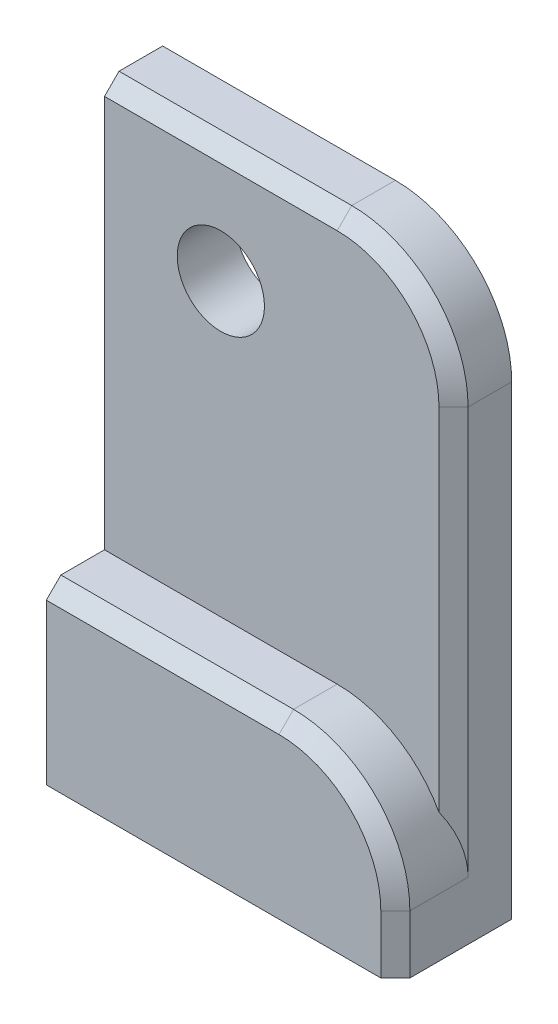
ISO-10303-21;
HEADER;
FILE_DESCRIPTION(('STEP AP214'),'2;1');
FILE_NAME('part.step','',(''),(''),'','','');
FILE_SCHEMA(('AUTOMOTIVE_DESIGN { 1 0 10303 214 1 1 1 1 }'));
ENDSEC;
DATA;
#1=APPLICATION_CONTEXT('core data for automotive mechanical design processes');
#2=APPLICATION_PROTOCOL_DEFINITION('international standard','automotive_design',2000,#1);
#3=PRODUCT_CONTEXT('',#1,'mechanical');
#4=PRODUCT('Part','Part','',(#3));
#5=PRODUCT_RELATED_PRODUCT_CATEGORY('part','',(#4));
#6=PRODUCT_DEFINITION_FORMATION('','',#4);
#7=PRODUCT_DEFINITION_CONTEXT('part definition',#1,'design');
#8=PRODUCT_DEFINITION('design','',#6,#7);
#9=PRODUCT_DEFINITION_SHAPE('','',#8);
#10=(LENGTH_UNIT() NAMED_UNIT(*) SI_UNIT(.MILLI.,.METRE.));
#11=(NAMED_UNIT(*) PLANE_ANGLE_UNIT() SI_UNIT($,.RADIAN.));
#12=(NAMED_UNIT(*) SI_UNIT($,.STERADIAN.) SOLID_ANGLE_UNIT());
#13=UNCERTAINTY_MEASURE_WITH_UNIT(LENGTH_MEASURE(1.E-05),#10,'distance_accuracy_value','');
#14=(GEOMETRIC_REPRESENTATION_CONTEXT(3) GLOBAL_UNCERTAINTY_ASSIGNED_CONTEXT((#13)) GLOBAL_UNIT_ASSIGNED_CONTEXT((#10,
#11,#12)) REPRESENTATION_CONTEXT('',''));
#15=CARTESIAN_POINT('',(0.,0.,0.));
#16=DIRECTION('',(0.,0.,1.));
#17=DIRECTION('',(1.,0.,0.));
#18=AXIS2_PLACEMENT_3D('',#15,#16,#17);
#19=CARTESIAN_POINT('',(0.,0.,0.));
#20=DIRECTION('',(0.,0.,-1.));
#21=DIRECTION('',(-1.,0.,0.));
#22=AXIS2_PLACEMENT_3D('',#19,#20,#21);
#23=PLANE('',#22);
#24=CARTESIAN_POINT('',(40.,80.,0.));
#25=DIRECTION('',(0.,0.,-1.));
#26=DIRECTION('',(-1.,0.,0.));
#27=AXIS2_PLACEMENT_3D('',#24,#25,#26);
#28=CIRCLE('',#27,18.);
#29=CARTESIAN_POINT('',(40.,98.,0.));
#30=VERTEX_POINT('',#29);
#31=CARTESIAN_POINT('',(58.,80.,0.));
#32=VERTEX_POINT('',#31);
#33=EDGE_CURVE('E272',#30,#32,#28,.T.);
#34=ORIENTED_EDGE('',*,*,#33,.F.);
#35=DIRECTION('',(-1.,0.,0.));
#36=VECTOR('',#35,1.);
#37=CARTESIAN_POINT('',(0.,98.,0.));
#38=LINE('',#37,#36);
#39=CARTESIAN_POINT('',(0.,98.,0.));
#40=VERTEX_POINT('',#39);
#41=EDGE_CURVE('E259',#30,#40,#38,.T.);
#42=ORIENTED_EDGE('',*,*,#41,.T.);
#43=DIRECTION('',(0.,-1.,0.));
#44=VECTOR('',#43,1.);
#45=CARTESIAN_POINT('',(0.,0.,0.));
#46=LINE('',#45,#44);
#47=CARTESIAN_POINT('',(0.,100.,0.));
#48=VERTEX_POINT('',#47);
#49=EDGE_CURVE('E329',#48,#40,#46,.T.);
#50=ORIENTED_EDGE('',*,*,#49,.F.);
#51=DIRECTION('',(-1.,0.,0.));
#52=VECTOR('',#51,1.);
#53=CARTESIAN_POINT('',(0.,100.,0.));
#54=LINE('',#53,#52);
#55=CARTESIAN_POINT('',(40.,100.,0.));
#56=VERTEX_POINT('',#55);
#57=EDGE_CURVE('E334',#56,#48,#54,.T.);
#58=ORIENTED_EDGE('',*,*,#57,.F.);
#59=CARTESIAN_POINT('',(40.,80.,0.));
#60=DIRECTION('',(0.,0.,-1.));
#61=DIRECTION('',(-1.,0.,0.));
#62=AXIS2_PLACEMENT_3D('',#59,#60,#61);
#63=CIRCLE('',#62,20.);
#64=CARTESIAN_POINT('',(60.,80.,0.));
#65=VERTEX_POINT('',#64);
#66=EDGE_CURVE('E372',#56,#65,#63,.T.);
#67=ORIENTED_EDGE('',*,*,#66,.T.);
#68=DIRECTION('',(0.,1.,0.));
#69=VECTOR('',#68,1.);
#70=CARTESIAN_POINT('',(60.,0.,0.));
#71=LINE('',#70,#69);
#72=CARTESIAN_POINT('',(60.,0.,0.));
#73=VERTEX_POINT('',#72);
#74=EDGE_CURVE('E341',#73,#65,#71,.T.);
#75=ORIENTED_EDGE('',*,*,#74,.F.);
#76=DIRECTION('',(1.,0.,0.));
#77=VECTOR('',#76,1.);
#78=CARTESIAN_POINT('',(0.,0.,0.));
#79=LINE('',#78,#77);
#80=CARTESIAN_POINT('',(58.,0.,0.));
#81=VERTEX_POINT('',#80);
#82=EDGE_CURVE('E338',#81,#73,#79,.T.);
#83=ORIENTED_EDGE('',*,*,#82,.F.);
#84=DIRECTION('',(0.,1.,0.));
#85=VECTOR('',#84,1.);
#86=CARTESIAN_POINT('',(58.,0.,0.));
#87=LINE('',#86,#85);
#88=EDGE_CURVE('E271',#81,#32,#87,.T.);
#89=ORIENTED_EDGE('',*,*,#88,.T.);
#90=EDGE_LOOP('',(#34,#42,#50,#58,#67,#75,#83,#89));
#91=FACE_BOUND('',#90,.T.);
#92=ADVANCED_FACE('F41',(#91),#23,.T.);
#93=CARTESIAN_POINT('',(0.,0.,10.));
#94=DIRECTION('',(0.,0.,-1.));
#95=DIRECTION('',(-1.,0.,0.));
#96=AXIS2_PLACEMENT_3D('',#93,#94,#95);
#97=PLANE('',#96);
#98=CARTESIAN_POINT('',(20.,80.,10.));
#99=DIRECTION('',(0.,0.,1.));
#100=DIRECTION('',(1.,0.,0.));
#101=AXIS2_PLACEMENT_3D('',#98,#99,#100);
#102=CIRCLE('',#101,7.5);
#103=CARTESIAN_POINT('',(27.5,80.,10.));
#104=VERTEX_POINT('',#103);
#105=EDGE_CURVE('E310',#104,#104,#102,.T.);
#106=ORIENTED_EDGE('',*,*,#105,.F.);
#107=EDGE_LOOP('',(#106));
#108=FACE_BOUND('',#107,.T.);
#109=CARTESIAN_POINT('',(40.,10.,10.));
#110=DIRECTION('',(0.,0.,-1.));
#111=DIRECTION('',(-1.,0.,0.));
#112=AXIS2_PLACEMENT_3D('',#109,#110,#111);
#113=CIRCLE('',#112,20.);
#114=CARTESIAN_POINT('',(40.,30.,10.));
#115=VERTEX_POINT('',#114);
#116=CARTESIAN_POINT('',(57.5,19.6824583655185,10.));
#117=VERTEX_POINT('',#116);
#118=EDGE_CURVE('E375',#115,#117,#113,.T.);
#119=ORIENTED_EDGE('',*,*,#118,.T.);
#120=DIRECTION('',(0.,1.,0.));
#121=VECTOR('',#120,1.);
#122=CARTESIAN_POINT('',(57.5,0.,10.));
#123=LINE('',#122,#121);
#124=CARTESIAN_POINT('',(57.5,80.,10.));
#125=VERTEX_POINT('',#124);
#126=EDGE_CURVE('E417',#117,#125,#123,.T.);
#127=ORIENTED_EDGE('',*,*,#126,.T.);
#128=CARTESIAN_POINT('',(40.,80.,10.));
#129=DIRECTION('',(0.,0.,-1.));
#130=DIRECTION('',(-1.,0.,0.));
#131=AXIS2_PLACEMENT_3D('',#128,#129,#130);
#132=CIRCLE('',#131,17.5);
#133=CARTESIAN_POINT('',(40.,97.5,10.));
#134=VERTEX_POINT('',#133);
#135=EDGE_CURVE('E414',#125,#134,#132,.F.);
#136=ORIENTED_EDGE('',*,*,#135,.T.);
#137=DIRECTION('',(-1.,0.,0.));
#138=VECTOR('',#137,1.);
#139=CARTESIAN_POINT('',(0.,97.5,10.));
#140=LINE('',#139,#138);
#141=CARTESIAN_POINT('',(0.,97.5,10.));
#142=VERTEX_POINT('',#141);
#143=EDGE_CURVE('E411',#134,#142,#140,.T.);
#144=ORIENTED_EDGE('',*,*,#143,.T.);
#145=DIRECTION('',(0.,-1.,0.));
#146=VECTOR('',#145,1.);
#147=CARTESIAN_POINT('',(0.,0.,10.));
#148=LINE('',#147,#146);
#149=CARTESIAN_POINT('',(0.,30.,10.));
#150=VERTEX_POINT('',#149);
#151=EDGE_CURVE('E330',#142,#150,#148,.T.);
#152=ORIENTED_EDGE('',*,*,#151,.T.);
#153=DIRECTION('',(-1.,0.,0.));
#154=VECTOR('',#153,1.);
#155=CARTESIAN_POINT('',(0.,30.,10.));
#156=LINE('',#155,#154);
#157=EDGE_CURVE('E309',#115,#150,#156,.T.);
#158=ORIENTED_EDGE('',*,*,#157,.F.);
#159=EDGE_LOOP('',(#119,#127,#136,#144,#152,#158));
#160=FACE_BOUND('',#159,.T.);
#161=ADVANCED_FACE('F528',(#108,#160),#97,.F.);
#162=CARTESIAN_POINT('',(0.,0.,10.));
#163=DIRECTION('',(1.,0.,0.));
#164=DIRECTION('',(0.,0.,-1.));
#165=AXIS2_PLACEMENT_3D('',#162,#163,#164);
#166=PLANE('',#165);
#167=DIRECTION('',(0.,-0.707106781186546,0.707106781186549));
#168=VECTOR('',#167,1.);
#169=CARTESIAN_POINT('',(0.,26.0857864376269,18.5857864376269));
#170=LINE('',#169,#168);
#171=CARTESIAN_POINT('',(0.,26.6715728752538,18.));
#172=VERTEX_POINT('',#171);
#173=CARTESIAN_POINT('',(0.,28.,16.6715728752538));
#174=VERTEX_POINT('',#173);
#175=EDGE_CURVE('E263',#172,#174,#170,.F.);
#176=ORIENTED_EDGE('',*,*,#175,.F.);
#177=DIRECTION('',(0.,-1.,0.));
#178=VECTOR('',#177,1.);
#179=CARTESIAN_POINT('',(0.,0.,18.));
#180=LINE('',#179,#178);
#181=CARTESIAN_POINT('',(0.,0.,18.));
#182=VERTEX_POINT('',#181);
#183=EDGE_CURVE('E292',#172,#182,#180,.T.);
#184=ORIENTED_EDGE('',*,*,#183,.T.);
#185=DIRECTION('',(0.,0.,-1.));
#186=VECTOR('',#185,1.);
#187=CARTESIAN_POINT('',(0.,0.,10.));
#188=LINE('',#187,#186);
#189=CARTESIAN_POINT('',(0.,0.,20.));
#190=VERTEX_POINT('',#189);
#191=EDGE_CURVE('E354',#190,#182,#188,.T.);
#192=ORIENTED_EDGE('',*,*,#191,.F.);
#193=DIRECTION('',(0.,-1.,0.));
#194=VECTOR('',#193,1.);
#195=CARTESIAN_POINT('',(0.,0.,20.));
#196=LINE('',#195,#194);
#197=CARTESIAN_POINT('',(0.,27.5,20.));
#198=VERTEX_POINT('',#197);
#199=EDGE_CURVE('E315',#198,#190,#196,.T.);
#200=ORIENTED_EDGE('',*,*,#199,.F.);
#201=DIRECTION('',(0.,-0.707106781186546,0.707106781186549));
#202=VECTOR('',#201,1.);
#203=CARTESIAN_POINT('',(0.,27.5,20.));
#204=LINE('',#203,#202);
#205=CARTESIAN_POINT('',(0.,30.,17.5));
#206=VERTEX_POINT('',#205);
#207=EDGE_CURVE('E405',#198,#206,#204,.F.);
#208=ORIENTED_EDGE('',*,*,#207,.T.);
#209=DIRECTION('',(0.,0.,-1.));
#210=VECTOR('',#209,1.);
#211=CARTESIAN_POINT('',(0.,30.,20.));
#212=LINE('',#211,#210);
#213=EDGE_CURVE('E322',#206,#150,#212,.T.);
#214=ORIENTED_EDGE('',*,*,#213,.T.);
#215=ORIENTED_EDGE('',*,*,#151,.F.);
#216=DIRECTION('',(0.,-0.707106781186546,0.707106781186549));
#217=VECTOR('',#216,1.);
#218=CARTESIAN_POINT('',(0.,97.5,10.));
#219=LINE('',#218,#217);
#220=CARTESIAN_POINT('',(0.,100.,7.50000000000001));
#221=VERTEX_POINT('',#220);
#222=EDGE_CURVE('E402',#142,#221,#219,.F.);
#223=ORIENTED_EDGE('',*,*,#222,.T.);
#224=DIRECTION('',(0.,0.,-1.));
#225=VECTOR('',#224,1.);
#226=CARTESIAN_POINT('',(0.,100.,10.));
#227=LINE('',#226,#225);
#228=EDGE_CURVE('E333',#221,#48,#227,.T.);
#229=ORIENTED_EDGE('',*,*,#228,.T.);
#230=ORIENTED_EDGE('',*,*,#49,.T.);
#231=DIRECTION('',(0.,0.,-1.));
#232=VECTOR('',#231,1.);
#233=CARTESIAN_POINT('',(0.,98.,10.));
#234=LINE('',#233,#232);
#235=CARTESIAN_POINT('',(0.,98.,6.67157287525382));
#236=VERTEX_POINT('',#235);
#237=EDGE_CURVE('E258',#236,#40,#234,.T.);
#238=ORIENTED_EDGE('',*,*,#237,.F.);
#239=DIRECTION('',(0.,-0.707106781186546,0.707106781186549));
#240=VECTOR('',#239,1.);
#241=CARTESIAN_POINT('',(0.,96.0857864376269,8.58578643762691));
#242=LINE('',#241,#240);
#243=CARTESIAN_POINT('',(0.,96.6715728752538,8.));
#244=VERTEX_POINT('',#243);
#245=EDGE_CURVE('E260',#244,#236,#242,.F.);
#246=ORIENTED_EDGE('',*,*,#245,.F.);
#247=DIRECTION('',(0.,-1.,0.));
#248=VECTOR('',#247,1.);
#249=CARTESIAN_POINT('',(0.,0.,8.));
#250=LINE('',#249,#248);
#251=CARTESIAN_POINT('',(0.,28.,8.));
#252=VERTEX_POINT('',#251);
#253=EDGE_CURVE('E219',#244,#252,#250,.T.);
#254=ORIENTED_EDGE('',*,*,#253,.T.);
#255=DIRECTION('',(0.,0.,-1.));
#256=VECTOR('',#255,1.);
#257=CARTESIAN_POINT('',(0.,28.,10.));
#258=LINE('',#257,#256);
#259=EDGE_CURVE('E279',#174,#252,#258,.T.);
#260=ORIENTED_EDGE('',*,*,#259,.F.);
#261=EDGE_LOOP('',(#176,#184,#192,#200,#208,#214,#215,#223,#229,#230,#238,#246,#254,#260));
#262=FACE_BOUND('',#261,.T.);
#263=ADVANCED_FACE('F500',(#262),#166,.F.);
#264=CARTESIAN_POINT('',(0.,0.,10.));
#265=DIRECTION('',(0.,1.,0.));
#266=DIRECTION('',(0.,0.,1.));
#267=AXIS2_PLACEMENT_3D('',#264,#265,#266);
#268=PLANE('',#267);
#269=DIRECTION('',(0.707106781186546,0.,-0.707106781186549));
#270=VECTOR('',#269,1.);
#271=CARTESIAN_POINT('',(56.0857864376269,0.,18.5857864376269));
#272=LINE('',#271,#270);
#273=CARTESIAN_POINT('',(58.,0.,16.6715728752538));
#274=VERTEX_POINT('',#273);
#275=CARTESIAN_POINT('',(56.6715728752538,0.,18.));
#276=VERTEX_POINT('',#275);
#277=EDGE_CURVE('E284',#274,#276,#272,.F.);
#278=ORIENTED_EDGE('',*,*,#277,.F.);
#279=DIRECTION('',(0.,0.,-1.));
#280=VECTOR('',#279,1.);
#281=CARTESIAN_POINT('',(58.,0.,10.));
#282=LINE('',#281,#280);
#283=EDGE_CURVE('E267',#274,#81,#282,.T.);
#284=ORIENTED_EDGE('',*,*,#283,.T.);
#285=ORIENTED_EDGE('',*,*,#82,.T.);
#286=DIRECTION('',(0.,0.,-1.));
#287=VECTOR('',#286,1.);
#288=CARTESIAN_POINT('',(60.,0.,10.));
#289=LINE('',#288,#287);
#290=CARTESIAN_POINT('',(60.,0.,17.5));
#291=VERTEX_POINT('',#290);
#292=EDGE_CURVE('E350',#291,#73,#289,.T.);
#293=ORIENTED_EDGE('',*,*,#292,.F.);
#294=DIRECTION('',(0.707106781186546,0.,-0.707106781186549));
#295=VECTOR('',#294,1.);
#296=CARTESIAN_POINT('',(57.5,0.,20.));
#297=LINE('',#296,#295);
#298=CARTESIAN_POINT('',(57.5,0.,20.));
#299=VERTEX_POINT('',#298);
#300=EDGE_CURVE('E396',#291,#299,#297,.F.);
#301=ORIENTED_EDGE('',*,*,#300,.T.);
#302=DIRECTION('',(1.,0.,0.));
#303=VECTOR('',#302,1.);
#304=CARTESIAN_POINT('',(0.,0.,20.));
#305=LINE('',#304,#303);
#306=EDGE_CURVE('E318',#190,#299,#305,.T.);
#307=ORIENTED_EDGE('',*,*,#306,.F.);
#308=ORIENTED_EDGE('',*,*,#191,.T.);
#309=DIRECTION('',(1.,0.,0.));
#310=VECTOR('',#309,1.);
#311=CARTESIAN_POINT('',(0.,0.,18.));
#312=LINE('',#311,#310);
#313=EDGE_CURVE('E288',#182,#276,#312,.T.);
#314=ORIENTED_EDGE('',*,*,#313,.T.);
#315=EDGE_LOOP('',(#278,#284,#285,#293,#301,#307,#308,#314));
#316=FACE_BOUND('',#315,.T.);
#317=ADVANCED_FACE('F494',(#316),#268,.F.);
#318=CARTESIAN_POINT('',(60.,0.,10.));
#319=DIRECTION('',(-1.,0.,0.));
#320=DIRECTION('',(0.,0.,1.));
#321=AXIS2_PLACEMENT_3D('',#318,#319,#320);
#322=PLANE('',#321);
#323=DIRECTION('',(0.,0.,-1.));
#324=VECTOR('',#323,1.);
#325=CARTESIAN_POINT('',(60.,10.,10.));
#326=LINE('',#325,#324);
#327=CARTESIAN_POINT('',(60.,10.,7.50000000000001));
#328=VERTEX_POINT('',#327);
#329=CARTESIAN_POINT('',(60.,10.,17.5));
#330=VERTEX_POINT('',#329);
#331=EDGE_CURVE('E365',#328,#330,#326,.F.);
#332=ORIENTED_EDGE('',*,*,#331,.T.);
#333=DIRECTION('',(0.,-1.,0.));
#334=VECTOR('',#333,1.);
#335=CARTESIAN_POINT('',(60.,0.,17.5));
#336=LINE('',#335,#334);
#337=EDGE_CURVE('E393',#330,#291,#336,.T.);
#338=ORIENTED_EDGE('',*,*,#337,.T.);
#339=ORIENTED_EDGE('',*,*,#292,.T.);
#340=ORIENTED_EDGE('',*,*,#74,.T.);
#341=DIRECTION('',(0.,0.,-1.));
#342=VECTOR('',#341,1.);
#343=CARTESIAN_POINT('',(60.,80.,10.));
#344=LINE('',#343,#342);
#345=CARTESIAN_POINT('',(60.,80.,7.50000000000001));
#346=VERTEX_POINT('',#345);
#347=EDGE_CURVE('E361',#65,#346,#344,.F.);
#348=ORIENTED_EDGE('',*,*,#347,.T.);
#349=DIRECTION('',(0.,-1.,0.));
#350=VECTOR('',#349,1.);
#351=CARTESIAN_POINT('',(60.,0.,7.50000000000001));
#352=LINE('',#351,#350);
#353=EDGE_CURVE('E389',#346,#328,#352,.T.);
#354=ORIENTED_EDGE('',*,*,#353,.T.);
#355=EDGE_LOOP('',(#332,#338,#339,#340,#348,#354));
#356=FACE_BOUND('',#355,.T.);
#357=ADVANCED_FACE('F550',(#356),#322,.F.);
#358=CARTESIAN_POINT('',(0.,100.,10.));
#359=DIRECTION('',(0.,-1.,0.));
#360=DIRECTION('',(0.,0.,-1.));
#361=AXIS2_PLACEMENT_3D('',#358,#359,#360);
#362=PLANE('',#361);
#363=ORIENTED_EDGE('',*,*,#228,.F.);
#364=DIRECTION('',(1.,0.,0.));
#365=VECTOR('',#364,1.);
#366=CARTESIAN_POINT('',(0.,100.,7.50000000000001));
#367=LINE('',#366,#365);
#368=CARTESIAN_POINT('',(40.,100.,7.50000000000001));
#369=VERTEX_POINT('',#368);
#370=EDGE_CURVE('E51',#221,#369,#367,.T.);
#371=ORIENTED_EDGE('',*,*,#370,.T.);
#372=DIRECTION('',(0.,0.,-1.));
#373=VECTOR('',#372,1.);
#374=CARTESIAN_POINT('',(40.,100.,10.));
#375=LINE('',#374,#373);
#376=EDGE_CURVE('E369',#369,#56,#375,.T.);
#377=ORIENTED_EDGE('',*,*,#376,.T.);
#378=ORIENTED_EDGE('',*,*,#57,.T.);
#379=EDGE_LOOP('',(#363,#371,#377,#378));
#380=FACE_BOUND('',#379,.T.);
#381=ADVANCED_FACE('F541',(#380),#362,.F.);
#382=CARTESIAN_POINT('',(20.,80.,0.));
#383=DIRECTION('',(0.,0.,-1.));
#384=DIRECTION('',(-1.,0.,0.));
#385=AXIS2_PLACEMENT_3D('',#382,#383,#384);
#386=CIRCLE('',#385,9.5);
#387=CARTESIAN_POINT('',(10.5,80.,0.));
#388=VERTEX_POINT('',#387);
#389=EDGE_CURVE('E301',#388,#388,#386,.F.);
#390=ORIENTED_EDGE('',*,*,#389,.F.);
#391=EDGE_LOOP('',(#390));
#392=FACE_BOUND('',#391,.T.);
#393=CARTESIAN_POINT('',(20.,80.,0.));
#394=DIRECTION('',(0.,0.,1.));
#395=DIRECTION('',(1.,0.,0.));
#396=AXIS2_PLACEMENT_3D('',#393,#394,#395);
#397=CIRCLE('',#396,7.5);
#398=CARTESIAN_POINT('',(27.5,80.,0.));
#399=VERTEX_POINT('',#398);
#400=EDGE_CURVE('E305',#399,#399,#397,.T.);
#401=ORIENTED_EDGE('',*,*,#400,.T.);
#402=EDGE_LOOP('',(#401));
#403=FACE_BOUND('',#402,.T.);
#404=ADVANCED_FACE('F531',(#392,#403),#23,.T.);
#405=CARTESIAN_POINT('',(0.,30.,20.));
#406=DIRECTION('',(0.,-1.,0.));
#407=DIRECTION('',(0.,0.,-1.));
#408=AXIS2_PLACEMENT_3D('',#405,#406,#407);
#409=PLANE('',#408);
#410=ORIENTED_EDGE('',*,*,#213,.F.);
#411=DIRECTION('',(1.,0.,0.));
#412=VECTOR('',#411,1.);
#413=CARTESIAN_POINT('',(0.,30.,17.5));
#414=LINE('',#413,#412);
#415=CARTESIAN_POINT('',(40.,30.,17.5));
#416=VERTEX_POINT('',#415);
#417=EDGE_CURVE('E408',#206,#416,#414,.T.);
#418=ORIENTED_EDGE('',*,*,#417,.T.);
#419=DIRECTION('',(0.,0.,-1.));
#420=VECTOR('',#419,1.);
#421=CARTESIAN_POINT('',(40.,30.,20.));
#422=LINE('',#421,#420);
#423=EDGE_CURVE('E358',#416,#115,#422,.T.);
#424=ORIENTED_EDGE('',*,*,#423,.T.);
#425=ORIENTED_EDGE('',*,*,#157,.T.);
#426=EDGE_LOOP('',(#410,#418,#424,#425));
#427=FACE_BOUND('',#426,.T.);
#428=ADVANCED_FACE('F540',(#427),#409,.F.);
#429=CARTESIAN_POINT('',(0.,0.,20.));
#430=DIRECTION('',(0.,0.,-1.));
#431=DIRECTION('',(-1.,0.,0.));
#432=AXIS2_PLACEMENT_3D('',#429,#430,#431);
#433=PLANE('',#432);
#434=ORIENTED_EDGE('',*,*,#306,.T.);
#435=DIRECTION('',(0.,1.,0.));
#436=VECTOR('',#435,1.);
#437=CARTESIAN_POINT('',(57.5,0.,20.));
#438=LINE('',#437,#436);
#439=CARTESIAN_POINT('',(57.5,10.,20.));
#440=VERTEX_POINT('',#439);
#441=EDGE_CURVE('E385',#299,#440,#438,.T.);
#442=ORIENTED_EDGE('',*,*,#441,.T.);
#443=CARTESIAN_POINT('',(40.,10.,20.));
#444=DIRECTION('',(0.,0.,-1.));
#445=DIRECTION('',(-1.,0.,0.));
#446=AXIS2_PLACEMENT_3D('',#443,#444,#445);
#447=CIRCLE('',#446,17.5);
#448=CARTESIAN_POINT('',(40.,27.5,20.));
#449=VERTEX_POINT('',#448);
#450=EDGE_CURVE('E382',#440,#449,#447,.F.);
#451=ORIENTED_EDGE('',*,*,#450,.T.);
#452=DIRECTION('',(-1.,0.,0.));
#453=VECTOR('',#452,1.);
#454=CARTESIAN_POINT('',(0.,27.5,20.));
#455=LINE('',#454,#453);
#456=EDGE_CURVE('E379',#449,#198,#455,.T.);
#457=ORIENTED_EDGE('',*,*,#456,.T.);
#458=ORIENTED_EDGE('',*,*,#199,.T.);
#459=EDGE_LOOP('',(#434,#442,#451,#457,#458));
#460=FACE_BOUND('',#459,.T.);
#461=ADVANCED_FACE('F547',(#460),#433,.F.);
#462=CARTESIAN_POINT('',(20.,80.,0.));
#463=DIRECTION('',(0.,0.,1.));
#464=DIRECTION('',(1.,0.,0.));
#465=AXIS2_PLACEMENT_3D('',#462,#463,#464);
#466=CYLINDRICAL_SURFACE('',#465,7.5);
#467=ORIENTED_EDGE('',*,*,#400,.F.);
#468=EDGE_LOOP('',(#467));
#469=FACE_BOUND('',#468,.T.);
#470=ORIENTED_EDGE('',*,*,#105,.T.);
#471=EDGE_LOOP('',(#470));
#472=FACE_BOUND('',#471,.T.);
#473=ADVANCED_FACE('F555',(#469,#472),#466,.F.);
#474=CARTESIAN_POINT('',(40.,10.,20.));
#475=DIRECTION('',(0.,0.,-1.));
#476=DIRECTION('',(-1.,0.,0.));
#477=AXIS2_PLACEMENT_3D('',#474,#475,#476);
#478=CYLINDRICAL_SURFACE('',#477,20.);
#479=ORIENTED_EDGE('',*,*,#423,.F.);
#480=CARTESIAN_POINT('',(40.,10.,17.5));
#481=DIRECTION('',(0.,0.,-1.));
#482=DIRECTION('',(-1.,0.,0.));
#483=AXIS2_PLACEMENT_3D('',#480,#481,#482);
#484=CIRCLE('',#483,20.);
#485=EDGE_CURVE('E399',#416,#330,#484,.T.);
#486=ORIENTED_EDGE('',*,*,#485,.T.);
#487=ORIENTED_EDGE('',*,*,#331,.F.);
#488=CARTESIAN_POINT('',(40.,10.,27.5000000000001));
#489=DIRECTION('',(-0.707106781186549,0.,-0.707106781186546));
#490=DIRECTION('',(0.707106781186546,0.,-0.707106781186549));
#491=AXIS2_PLACEMENT_3D('',#488,#489,#490);
#492=ELLIPSE('',#491,28.284271247462,20.);
#493=EDGE_CURVE('E11',#328,#117,#492,.F.);
#494=ORIENTED_EDGE('',*,*,#493,.T.);
#495=ORIENTED_EDGE('',*,*,#118,.F.);
#496=EDGE_LOOP('',(#479,#486,#487,#494,#495));
#497=FACE_BOUND('',#496,.T.);
#498=ADVANCED_FACE('F558',(#497),#478,.T.);
#499=CARTESIAN_POINT('',(40.,80.,10.));
#500=DIRECTION('',(0.,0.,-1.));
#501=DIRECTION('',(-1.,0.,0.));
#502=AXIS2_PLACEMENT_3D('',#499,#500,#501);
#503=CYLINDRICAL_SURFACE('',#502,20.);
#504=ORIENTED_EDGE('',*,*,#376,.F.);
#505=CARTESIAN_POINT('',(40.,80.,7.50000000000001));
#506=DIRECTION('',(0.,0.,-1.));
#507=DIRECTION('',(-1.,0.,0.));
#508=AXIS2_PLACEMENT_3D('',#505,#506,#507);
#509=CIRCLE('',#508,20.);
#510=EDGE_CURVE('E421',#369,#346,#509,.T.);
#511=ORIENTED_EDGE('',*,*,#510,.T.);
#512=ORIENTED_EDGE('',*,*,#347,.F.);
#513=ORIENTED_EDGE('',*,*,#66,.F.);
#514=EDGE_LOOP('',(#504,#511,#512,#513));
#515=FACE_BOUND('',#514,.T.);
#516=ADVANCED_FACE('F575',(#515),#503,.T.);
#517=CARTESIAN_POINT('',(0.,27.5,20.));
#518=DIRECTION('',(0.,-0.707106781186549,-0.707106781186545));
#519=DIRECTION('',(-1.,0.,0.));
#520=AXIS2_PLACEMENT_3D('',#517,#518,#519);
#521=PLANE('',#520);
#522=ORIENTED_EDGE('',*,*,#207,.F.);
#523=ORIENTED_EDGE('',*,*,#456,.F.);
#524=DIRECTION('',(0.,-0.707106781186545,0.707106781186549));
#525=VECTOR('',#524,1.);
#526=CARTESIAN_POINT('',(40.,30.,17.5));
#527=LINE('',#526,#525);
#528=EDGE_CURVE('E314',#416,#449,#527,.T.);
#529=ORIENTED_EDGE('',*,*,#528,.F.);
#530=ORIENTED_EDGE('',*,*,#417,.F.);
#531=EDGE_LOOP('',(#522,#523,#529,#530));
#532=FACE_BOUND('',#531,.T.);
#533=ADVANCED_FACE('F615',(#532),#521,.F.);
#534=CARTESIAN_POINT('',(40.,10.,20.));
#535=DIRECTION('',(0.,0.,-1.));
#536=DIRECTION('',(-1.,0.,0.));
#537=AXIS2_PLACEMENT_3D('',#534,#535,#536);
#538=CONICAL_SURFACE('',#537,17.5,0.785398163397446);
#539=ORIENTED_EDGE('',*,*,#528,.T.);
#540=ORIENTED_EDGE('',*,*,#450,.F.);
#541=DIRECTION('',(-0.707106781186545,0.,0.707106781186549));
#542=VECTOR('',#541,1.);
#543=CARTESIAN_POINT('',(60.,10.,17.5));
#544=LINE('',#543,#542);
#545=EDGE_CURVE('E426',#330,#440,#544,.T.);
#546=ORIENTED_EDGE('',*,*,#545,.F.);
#547=ORIENTED_EDGE('',*,*,#485,.F.);
#548=EDGE_LOOP('',(#539,#540,#546,#547));
#549=FACE_BOUND('',#548,.T.);
#550=ADVANCED_FACE('F611',(#549),#538,.T.);
#551=CARTESIAN_POINT('',(57.5,0.,20.));
#552=DIRECTION('',(-0.707106781186549,0.,-0.707106781186545));
#553=DIRECTION('',(0.,1.,0.));
#554=AXIS2_PLACEMENT_3D('',#551,#552,#553);
#555=PLANE('',#554);
#556=ORIENTED_EDGE('',*,*,#300,.F.);
#557=ORIENTED_EDGE('',*,*,#337,.F.);
#558=ORIENTED_EDGE('',*,*,#545,.T.);
#559=ORIENTED_EDGE('',*,*,#441,.F.);
#560=EDGE_LOOP('',(#556,#557,#558,#559));
#561=FACE_BOUND('',#560,.T.);
#562=ADVANCED_FACE('F607',(#561),#555,.F.);
#563=CARTESIAN_POINT('',(0.,97.5,10.));
#564=DIRECTION('',(0.,-0.707106781186549,-0.707106781186546));
#565=DIRECTION('',(-1.,0.,0.));
#566=AXIS2_PLACEMENT_3D('',#563,#564,#565);
#567=PLANE('',#566);
#568=ORIENTED_EDGE('',*,*,#222,.F.);
#569=ORIENTED_EDGE('',*,*,#143,.F.);
#570=DIRECTION('',(0.,-0.707106781186546,0.707106781186549));
#571=VECTOR('',#570,1.);
#572=CARTESIAN_POINT('',(40.,100.,7.50000000000001));
#573=LINE('',#572,#571);
#574=EDGE_CURVE('E45',#369,#134,#573,.T.);
#575=ORIENTED_EDGE('',*,*,#574,.F.);
#576=ORIENTED_EDGE('',*,*,#370,.F.);
#577=EDGE_LOOP('',(#568,#569,#575,#576));
#578=FACE_BOUND('',#577,.T.);
#579=ADVANCED_FACE('F43',(#578),#567,.F.);
#580=CARTESIAN_POINT('',(40.,80.,10.));
#581=DIRECTION('',(0.,0.,-1.));
#582=DIRECTION('',(-1.,0.,0.));
#583=AXIS2_PLACEMENT_3D('',#580,#581,#582);
#584=CONICAL_SURFACE('',#583,17.5,0.785398163397445);
#585=ORIENTED_EDGE('',*,*,#574,.T.);
#586=ORIENTED_EDGE('',*,*,#135,.F.);
#587=DIRECTION('',(-0.707106781186546,0.,0.707106781186549));
#588=VECTOR('',#587,1.);
#589=CARTESIAN_POINT('',(60.,80.,7.50000000000001));
#590=LINE('',#589,#588);
#591=EDGE_CURVE('E431',#346,#125,#590,.T.);
#592=ORIENTED_EDGE('',*,*,#591,.F.);
#593=ORIENTED_EDGE('',*,*,#510,.F.);
#594=EDGE_LOOP('',(#585,#586,#592,#593));
#595=FACE_BOUND('',#594,.T.);
#596=ADVANCED_FACE('F580',(#595),#584,.T.);
#597=CARTESIAN_POINT('',(57.5,0.,10.));
#598=DIRECTION('',(-0.707106781186549,0.,-0.707106781186546));
#599=DIRECTION('',(0.,1.,0.));
#600=AXIS2_PLACEMENT_3D('',#597,#598,#599);
#601=PLANE('',#600);
#602=ORIENTED_EDGE('',*,*,#493,.F.);
#603=ORIENTED_EDGE('',*,*,#353,.F.);
#604=ORIENTED_EDGE('',*,*,#591,.T.);
#605=ORIENTED_EDGE('',*,*,#126,.F.);
#606=EDGE_LOOP('',(#602,#603,#604,#605));
#607=FACE_BOUND('',#606,.T.);
#608=ADVANCED_FACE('F567',(#607),#601,.F.);
#609=CARTESIAN_POINT('',(0.,0.,8.));
#610=DIRECTION('',(0.,0.,-1.));
#611=DIRECTION('',(-1.,0.,0.));
#612=AXIS2_PLACEMENT_3D('',#609,#610,#611);
#613=PLANE('',#612);
#614=CARTESIAN_POINT('',(20.,80.,8.));
#615=DIRECTION('',(0.,0.,-1.));
#616=DIRECTION('',(-1.,0.,0.));
#617=AXIS2_PLACEMENT_3D('',#614,#615,#616);
#618=CIRCLE('',#617,9.5);
#619=CARTESIAN_POINT('',(10.5,80.,8.));
#620=VERTEX_POINT('',#619);
#621=EDGE_CURVE('E243',#620,#620,#618,.F.);
#622=ORIENTED_EDGE('',*,*,#621,.T.);
#623=EDGE_LOOP('',(#622));
#624=FACE_BOUND('',#623,.T.);
#625=CARTESIAN_POINT('',(40.,10.,8.));
#626=DIRECTION('',(0.,0.,-1.));
#627=DIRECTION('',(-1.,0.,0.));
#628=AXIS2_PLACEMENT_3D('',#625,#626,#627);
#629=CIRCLE('',#628,18.);
#630=CARTESIAN_POINT('',(40.,28.,8.));
#631=VERTEX_POINT('',#630);
#632=CARTESIAN_POINT('',(56.6715728752538,16.7866529206304,8.));
#633=VERTEX_POINT('',#632);
#634=EDGE_CURVE('E255',#631,#633,#629,.T.);
#635=ORIENTED_EDGE('',*,*,#634,.F.);
#636=DIRECTION('',(-1.,0.,0.));
#637=VECTOR('',#636,1.);
#638=CARTESIAN_POINT('',(0.,28.,8.));
#639=LINE('',#638,#637);
#640=EDGE_CURVE('E296',#631,#252,#639,.T.);
#641=ORIENTED_EDGE('',*,*,#640,.T.);
#642=ORIENTED_EDGE('',*,*,#253,.F.);
#643=DIRECTION('',(1.,0.,0.));
#644=VECTOR('',#643,1.);
#645=CARTESIAN_POINT('',(0.,96.6715728752538,8.));
#646=LINE('',#645,#644);
#647=CARTESIAN_POINT('',(40.,96.6715728752538,8.));
#648=VERTEX_POINT('',#647);
#649=EDGE_CURVE('E212',#648,#244,#646,.F.);
#650=ORIENTED_EDGE('',*,*,#649,.F.);
#651=CARTESIAN_POINT('',(40.,80.,8.));
#652=DIRECTION('',(0.,0.,-1.));
#653=DIRECTION('',(-1.,0.,0.));
#654=AXIS2_PLACEMENT_3D('',#651,#652,#653);
#655=CIRCLE('',#654,16.6715728752538);
#656=CARTESIAN_POINT('',(56.6715728752538,80.,8.));
#657=VERTEX_POINT('',#656);
#658=EDGE_CURVE('E199',#657,#648,#655,.F.);
#659=ORIENTED_EDGE('',*,*,#658,.F.);
#660=DIRECTION('',(0.,-1.,0.));
#661=VECTOR('',#660,1.);
#662=CARTESIAN_POINT('',(56.6715728752538,0.,8.));
#663=LINE('',#662,#661);
#664=EDGE_CURVE('E211',#633,#657,#663,.F.);
#665=ORIENTED_EDGE('',*,*,#664,.F.);
#666=EDGE_LOOP('',(#635,#641,#642,#650,#659,#665));
#667=FACE_BOUND('',#666,.T.);
#668=ADVANCED_FACE('F216',(#624,#667),#613,.T.);
#669=CARTESIAN_POINT('',(58.,0.,10.));
#670=DIRECTION('',(-1.,0.,0.));
#671=DIRECTION('',(0.,0.,1.));
#672=AXIS2_PLACEMENT_3D('',#669,#670,#671);
#673=PLANE('',#672);
#674=DIRECTION('',(0.,0.,1.));
#675=VECTOR('',#674,1.);
#676=CARTESIAN_POINT('',(58.,10.,10.));
#677=LINE('',#676,#675);
#678=CARTESIAN_POINT('',(58.,10.,6.67157287525383));
#679=VERTEX_POINT('',#678);
#680=CARTESIAN_POINT('',(58.,10.,16.6715728752538));
#681=VERTEX_POINT('',#680);
#682=EDGE_CURVE('E451',#679,#681,#677,.T.);
#683=ORIENTED_EDGE('',*,*,#682,.F.);
#684=DIRECTION('',(0.,1.,0.));
#685=VECTOR('',#684,1.);
#686=CARTESIAN_POINT('',(58.,0.,6.67157287525383));
#687=LINE('',#686,#685);
#688=CARTESIAN_POINT('',(58.,80.,6.67157287525383));
#689=VERTEX_POINT('',#688);
#690=EDGE_CURVE('E252',#689,#679,#687,.F.);
#691=ORIENTED_EDGE('',*,*,#690,.F.);
#692=DIRECTION('',(0.,0.,1.));
#693=VECTOR('',#692,1.);
#694=CARTESIAN_POINT('',(58.,80.,10.));
#695=LINE('',#694,#693);
#696=EDGE_CURVE('E59',#32,#689,#695,.T.);
#697=ORIENTED_EDGE('',*,*,#696,.F.);
#698=ORIENTED_EDGE('',*,*,#88,.F.);
#699=ORIENTED_EDGE('',*,*,#283,.F.);
#700=DIRECTION('',(0.,1.,0.));
#701=VECTOR('',#700,1.);
#702=CARTESIAN_POINT('',(58.,0.,16.6715728752538));
#703=LINE('',#702,#701);
#704=EDGE_CURVE('E287',#681,#274,#703,.F.);
#705=ORIENTED_EDGE('',*,*,#704,.F.);
#706=EDGE_LOOP('',(#683,#691,#697,#698,#699,#705));
#707=FACE_BOUND('',#706,.T.);
#708=ADVANCED_FACE('F484',(#707),#673,.T.);
#709=CARTESIAN_POINT('',(0.,98.,10.));
#710=DIRECTION('',(0.,-1.,0.));
#711=DIRECTION('',(0.,0.,-1.));
#712=AXIS2_PLACEMENT_3D('',#709,#710,#711);
#713=PLANE('',#712);
#714=ORIENTED_EDGE('',*,*,#237,.T.);
#715=ORIENTED_EDGE('',*,*,#41,.F.);
#716=DIRECTION('',(0.,0.,-1.));
#717=VECTOR('',#716,1.);
#718=CARTESIAN_POINT('',(40.,98.,10.));
#719=LINE('',#718,#717);
#720=CARTESIAN_POINT('',(40.,98.,6.67157287525382));
#721=VERTEX_POINT('',#720);
#722=EDGE_CURVE('E275',#721,#30,#719,.T.);
#723=ORIENTED_EDGE('',*,*,#722,.F.);
#724=DIRECTION('',(-1.,0.,0.));
#725=VECTOR('',#724,1.);
#726=CARTESIAN_POINT('',(0.,98.,6.67157287525382));
#727=LINE('',#726,#725);
#728=EDGE_CURVE('E227',#236,#721,#727,.F.);
#729=ORIENTED_EDGE('',*,*,#728,.F.);
#730=EDGE_LOOP('',(#714,#715,#723,#729));
#731=FACE_BOUND('',#730,.T.);
#732=ADVANCED_FACE('F589',(#731),#713,.T.);
#733=CARTESIAN_POINT('',(0.,28.,20.));
#734=DIRECTION('',(0.,-1.,0.));
#735=DIRECTION('',(0.,0.,-1.));
#736=AXIS2_PLACEMENT_3D('',#733,#734,#735);
#737=PLANE('',#736);
#738=ORIENTED_EDGE('',*,*,#259,.T.);
#739=ORIENTED_EDGE('',*,*,#640,.F.);
#740=DIRECTION('',(0.,0.,-1.));
#741=VECTOR('',#740,1.);
#742=CARTESIAN_POINT('',(40.,28.,20.));
#743=LINE('',#742,#741);
#744=CARTESIAN_POINT('',(40.,28.,16.6715728752538));
#745=VERTEX_POINT('',#744);
#746=EDGE_CURVE('E283',#745,#631,#743,.T.);
#747=ORIENTED_EDGE('',*,*,#746,.F.);
#748=DIRECTION('',(-1.,0.,0.));
#749=VECTOR('',#748,1.);
#750=CARTESIAN_POINT('',(0.,28.,16.6715728752538));
#751=LINE('',#750,#749);
#752=EDGE_CURVE('E223',#174,#745,#751,.F.);
#753=ORIENTED_EDGE('',*,*,#752,.F.);
#754=EDGE_LOOP('',(#738,#739,#747,#753));
#755=FACE_BOUND('',#754,.T.);
#756=ADVANCED_FACE('F509',(#755),#737,.T.);
#757=CARTESIAN_POINT('',(0.,0.,18.));
#758=DIRECTION('',(0.,0.,-1.));
#759=DIRECTION('',(-1.,0.,0.));
#760=AXIS2_PLACEMENT_3D('',#757,#758,#759);
#761=PLANE('',#760);
#762=ORIENTED_EDGE('',*,*,#313,.F.);
#763=ORIENTED_EDGE('',*,*,#183,.F.);
#764=DIRECTION('',(1.,0.,0.));
#765=VECTOR('',#764,1.);
#766=CARTESIAN_POINT('',(0.,26.6715728752538,18.));
#767=LINE('',#766,#765);
#768=CARTESIAN_POINT('',(40.,26.6715728752538,18.));
#769=VERTEX_POINT('',#768);
#770=EDGE_CURVE('E247',#769,#172,#767,.F.);
#771=ORIENTED_EDGE('',*,*,#770,.F.);
#772=CARTESIAN_POINT('',(40.,10.,18.));
#773=DIRECTION('',(0.,0.,-1.));
#774=DIRECTION('',(-1.,0.,0.));
#775=AXIS2_PLACEMENT_3D('',#772,#773,#774);
#776=CIRCLE('',#775,16.6715728752538);
#777=CARTESIAN_POINT('',(56.6715728752538,10.,18.));
#778=VERTEX_POINT('',#777);
#779=EDGE_CURVE('E244',#778,#769,#776,.F.);
#780=ORIENTED_EDGE('',*,*,#779,.F.);
#781=DIRECTION('',(0.,-1.,0.));
#782=VECTOR('',#781,1.);
#783=CARTESIAN_POINT('',(56.6715728752538,0.,18.));
#784=LINE('',#783,#782);
#785=EDGE_CURVE('E246',#276,#778,#784,.F.);
#786=ORIENTED_EDGE('',*,*,#785,.F.);
#787=EDGE_LOOP('',(#762,#763,#771,#780,#786));
#788=FACE_BOUND('',#787,.T.);
#789=ADVANCED_FACE('F490',(#788),#761,.T.);
#790=CARTESIAN_POINT('',(20.,80.,0.));
#791=DIRECTION('',(0.,0.,1.));
#792=DIRECTION('',(1.,0.,0.));
#793=AXIS2_PLACEMENT_3D('',#790,#791,#792);
#794=CYLINDRICAL_SURFACE('',#793,9.5);
#795=ORIENTED_EDGE('',*,*,#389,.T.);
#796=EDGE_LOOP('',(#795));
#797=FACE_BOUND('',#796,.T.);
#798=ORIENTED_EDGE('',*,*,#621,.F.);
#799=EDGE_LOOP('',(#798));
#800=FACE_BOUND('',#799,.T.);
#801=ADVANCED_FACE('F516',(#797,#800),#794,.T.);
#802=CARTESIAN_POINT('',(40.,10.,20.));
#803=DIRECTION('',(0.,0.,-1.));
#804=DIRECTION('',(-1.,0.,0.));
#805=AXIS2_PLACEMENT_3D('',#802,#803,#804);
#806=CYLINDRICAL_SURFACE('',#805,18.);
#807=ORIENTED_EDGE('',*,*,#746,.T.);
#808=ORIENTED_EDGE('',*,*,#634,.T.);
#809=CARTESIAN_POINT('',(40.,10.,24.6715728752539));
#810=DIRECTION('',(-0.707106781186549,0.,-0.707106781186546));
#811=DIRECTION('',(0.707106781186546,0.,-0.707106781186549));
#812=AXIS2_PLACEMENT_3D('',#809,#810,#811);
#813=ELLIPSE('',#812,25.4558441227158,18.);
#814=EDGE_CURVE('E433',#679,#633,#813,.F.);
#815=ORIENTED_EDGE('',*,*,#814,.F.);
#816=ORIENTED_EDGE('',*,*,#682,.T.);
#817=CARTESIAN_POINT('',(40.,10.,16.6715728752538));
#818=DIRECTION('',(0.,0.,-1.));
#819=DIRECTION('',(-1.,0.,0.));
#820=AXIS2_PLACEMENT_3D('',#817,#818,#819);
#821=CIRCLE('',#820,18.);
#822=EDGE_CURVE('E264',#745,#681,#821,.T.);
#823=ORIENTED_EDGE('',*,*,#822,.F.);
#824=EDGE_LOOP('',(#807,#808,#815,#816,#823));
#825=FACE_BOUND('',#824,.T.);
#826=ADVANCED_FACE('F481',(#825),#806,.F.);
#827=CARTESIAN_POINT('',(40.,80.,10.));
#828=DIRECTION('',(0.,0.,-1.));
#829=DIRECTION('',(-1.,0.,0.));
#830=AXIS2_PLACEMENT_3D('',#827,#828,#829);
#831=CYLINDRICAL_SURFACE('',#830,18.);
#832=ORIENTED_EDGE('',*,*,#722,.T.);
#833=ORIENTED_EDGE('',*,*,#33,.T.);
#834=ORIENTED_EDGE('',*,*,#696,.T.);
#835=CARTESIAN_POINT('',(40.,80.,6.67157287525382));
#836=DIRECTION('',(0.,0.,-1.));
#837=DIRECTION('',(-1.,0.,0.));
#838=AXIS2_PLACEMENT_3D('',#835,#836,#837);
#839=CIRCLE('',#838,18.);
#840=EDGE_CURVE('E448',#721,#689,#839,.T.);
#841=ORIENTED_EDGE('',*,*,#840,.F.);
#842=EDGE_LOOP('',(#832,#833,#834,#841));
#843=FACE_BOUND('',#842,.T.);
#844=ADVANCED_FACE('F524',(#843),#831,.F.);
#845=CARTESIAN_POINT('',(0.,26.0857864376269,18.5857864376269));
#846=DIRECTION('',(0.,-0.707106781186549,-0.707106781186545));
#847=DIRECTION('',(-1.,0.,0.));
#848=AXIS2_PLACEMENT_3D('',#845,#846,#847);
#849=PLANE('',#848);
#850=ORIENTED_EDGE('',*,*,#175,.T.);
#851=ORIENTED_EDGE('',*,*,#752,.T.);
#852=DIRECTION('',(0.,0.707106781186546,-0.707106781186549));
#853=VECTOR('',#852,1.);
#854=CARTESIAN_POINT('',(40.,26.0857864376269,18.5857864376269));
#855=LINE('',#854,#853);
#856=EDGE_CURVE('E234',#745,#769,#855,.F.);
#857=ORIENTED_EDGE('',*,*,#856,.T.);
#858=ORIENTED_EDGE('',*,*,#770,.T.);
#859=EDGE_LOOP('',(#850,#851,#857,#858));
#860=FACE_BOUND('',#859,.T.);
#861=ADVANCED_FACE('F504',(#860),#849,.T.);
#862=CARTESIAN_POINT('',(40.,10.,18.5857864376269));
#863=DIRECTION('',(0.,0.,-1.));
#864=DIRECTION('',(-1.,0.,0.));
#865=AXIS2_PLACEMENT_3D('',#862,#863,#864);
#866=CONICAL_SURFACE('',#865,16.0857864376269,0.785398163397446);
#867=ORIENTED_EDGE('',*,*,#856,.F.);
#868=ORIENTED_EDGE('',*,*,#822,.T.);
#869=DIRECTION('',(0.707106781186545,0.,-0.707106781186549));
#870=VECTOR('',#869,1.);
#871=CARTESIAN_POINT('',(56.0857864376269,10.,18.5857864376269));
#872=LINE('',#871,#870);
#873=EDGE_CURVE('E230',#681,#778,#872,.F.);
#874=ORIENTED_EDGE('',*,*,#873,.T.);
#875=ORIENTED_EDGE('',*,*,#779,.T.);
#876=EDGE_LOOP('',(#867,#868,#874,#875));
#877=FACE_BOUND('',#876,.T.);
#878=ADVANCED_FACE('F476',(#877),#866,.F.);
#879=CARTESIAN_POINT('',(56.0857864376269,0.,18.5857864376269));
#880=DIRECTION('',(-0.707106781186549,0.,-0.707106781186545));
#881=DIRECTION('',(0.,1.,0.));
#882=AXIS2_PLACEMENT_3D('',#879,#880,#881);
#883=PLANE('',#882);
#884=ORIENTED_EDGE('',*,*,#277,.T.);
#885=ORIENTED_EDGE('',*,*,#785,.T.);
#886=ORIENTED_EDGE('',*,*,#873,.F.);
#887=ORIENTED_EDGE('',*,*,#704,.T.);
#888=EDGE_LOOP('',(#884,#885,#886,#887));
#889=FACE_BOUND('',#888,.T.);
#890=ADVANCED_FACE('F487',(#889),#883,.T.);
#891=CARTESIAN_POINT('',(0.,96.0857864376269,8.58578643762691));
#892=DIRECTION('',(0.,-0.707106781186549,-0.707106781186546));
#893=DIRECTION('',(-1.,0.,0.));
#894=AXIS2_PLACEMENT_3D('',#891,#892,#893);
#895=PLANE('',#894);
#896=ORIENTED_EDGE('',*,*,#245,.T.);
#897=ORIENTED_EDGE('',*,*,#728,.T.);
#898=DIRECTION('',(0.,0.707106781186545,-0.70710678118655));
#899=VECTOR('',#898,1.);
#900=CARTESIAN_POINT('',(40.,96.0857864376269,8.58578643762691));
#901=LINE('',#900,#899);
#902=EDGE_CURVE('E203',#721,#648,#901,.F.);
#903=ORIENTED_EDGE('',*,*,#902,.T.);
#904=ORIENTED_EDGE('',*,*,#649,.T.);
#905=EDGE_LOOP('',(#896,#897,#903,#904));
#906=FACE_BOUND('',#905,.T.);
#907=ADVANCED_FACE('F225',(#906),#895,.T.);
#908=CARTESIAN_POINT('',(40.,80.,8.58578643762691));
#909=DIRECTION('',(0.,0.,-1.));
#910=DIRECTION('',(-1.,0.,0.));
#911=AXIS2_PLACEMENT_3D('',#908,#909,#910);
#912=CONICAL_SURFACE('',#911,16.0857864376269,0.785398163397445);
#913=ORIENTED_EDGE('',*,*,#902,.F.);
#914=ORIENTED_EDGE('',*,*,#840,.T.);
#915=DIRECTION('',(0.707106781186546,0.,-0.707106781186549));
#916=VECTOR('',#915,1.);
#917=CARTESIAN_POINT('',(56.0857864376269,80.,8.58578643762691));
#918=LINE('',#917,#916);
#919=EDGE_CURVE('E206',#689,#657,#918,.F.);
#920=ORIENTED_EDGE('',*,*,#919,.T.);
#921=ORIENTED_EDGE('',*,*,#658,.T.);
#922=EDGE_LOOP('',(#913,#914,#920,#921));
#923=FACE_BOUND('',#922,.T.);
#924=ADVANCED_FACE('F201',(#923),#912,.F.);
#925=CARTESIAN_POINT('',(56.0857864376269,0.,8.58578643762691));
#926=DIRECTION('',(-0.707106781186549,0.,-0.707106781186546));
#927=DIRECTION('',(0.,1.,0.));
#928=AXIS2_PLACEMENT_3D('',#925,#926,#927);
#929=PLANE('',#928);
#930=ORIENTED_EDGE('',*,*,#814,.T.);
#931=ORIENTED_EDGE('',*,*,#664,.T.);
#932=ORIENTED_EDGE('',*,*,#919,.F.);
#933=ORIENTED_EDGE('',*,*,#690,.T.);
#934=EDGE_LOOP('',(#930,#931,#932,#933));
#935=FACE_BOUND('',#934,.T.);
#936=ADVANCED_FACE('F591',(#935),#929,.T.);
#937=CLOSED_SHELL('',(#92,#161,#263,#317,#357,#381,#404,#428,#461,#473,#498,#516,#533,#550,#562,
#579,#596,#608,#668,#708,#732,#756,#789,#801,#826,#844,#861,#878,#890,#907,#924,#936));
#938=MANIFOLD_SOLID_BREP('B2',#937);
#939=ADVANCED_BREP_SHAPE_REPRESENTATION('',(#18,#938),#14);
#940=SHAPE_DEFINITION_REPRESENTATION(#9,#939);
ENDSEC;
END-ISO-10303-21;
